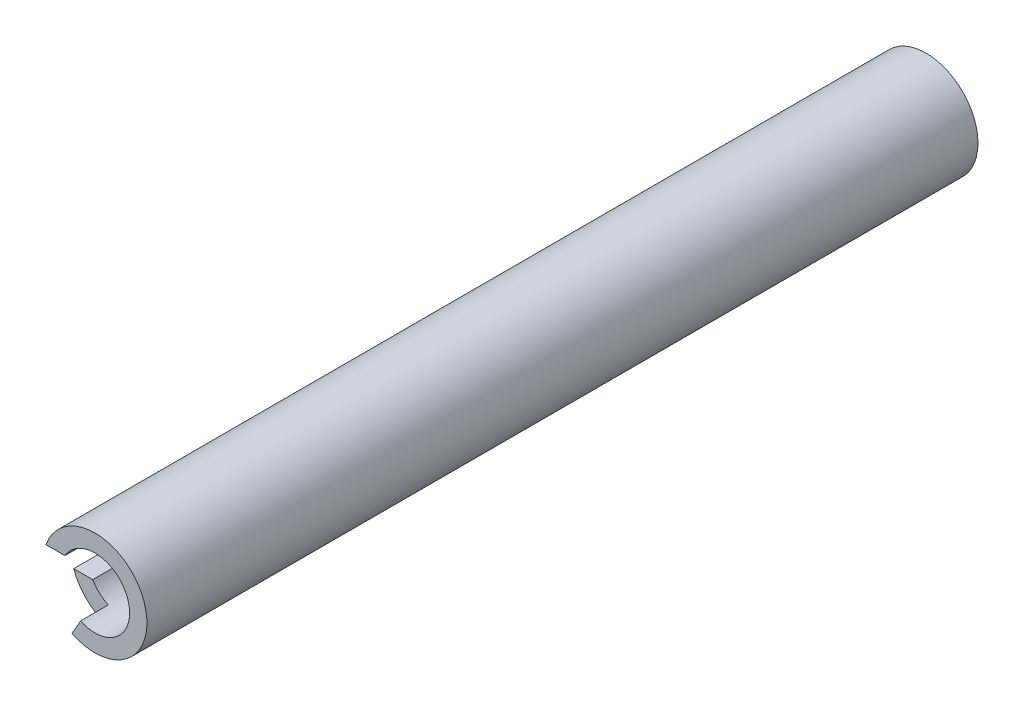
ISO-10303-21;
HEADER;
FILE_DESCRIPTION(('STEP AP214'),'2;1');
FILE_NAME('part.step','',(''),(''),'','','');
FILE_SCHEMA(('AUTOMOTIVE_DESIGN { 1 0 10303 214 1 1 1 1 }'));
ENDSEC;
DATA;
#1=APPLICATION_CONTEXT('core data for automotive mechanical design processes');
#2=APPLICATION_PROTOCOL_DEFINITION('international standard','automotive_design',2000,#1);
#3=PRODUCT_CONTEXT('',#1,'mechanical');
#4=PRODUCT('Part','Part','',(#3));
#5=PRODUCT_RELATED_PRODUCT_CATEGORY('part','',(#4));
#6=PRODUCT_DEFINITION_FORMATION('','',#4);
#7=PRODUCT_DEFINITION_CONTEXT('part definition',#1,'design');
#8=PRODUCT_DEFINITION('design','',#6,#7);
#9=PRODUCT_DEFINITION_SHAPE('','',#8);
#10=(LENGTH_UNIT() NAMED_UNIT(*) SI_UNIT(.MILLI.,.METRE.));
#11=(NAMED_UNIT(*) PLANE_ANGLE_UNIT() SI_UNIT($,.RADIAN.));
#12=(NAMED_UNIT(*) SI_UNIT($,.STERADIAN.) SOLID_ANGLE_UNIT());
#13=UNCERTAINTY_MEASURE_WITH_UNIT(LENGTH_MEASURE(1.E-05),#10,'distance_accuracy_value','');
#14=(GEOMETRIC_REPRESENTATION_CONTEXT(3) GLOBAL_UNCERTAINTY_ASSIGNED_CONTEXT((#13)) GLOBAL_UNIT_ASSIGNED_CONTEXT((#10,
#11,#12)) REPRESENTATION_CONTEXT('',''));
#15=CARTESIAN_POINT('',(0.,0.,0.));
#16=DIRECTION('',(0.,0.,1.));
#17=DIRECTION('',(1.,0.,0.));
#18=AXIS2_PLACEMENT_3D('',#15,#16,#17);
#19=CARTESIAN_POINT('',(0.,0.,304.8));
#20=DIRECTION('',(0.,0.,-1.));
#21=DIRECTION('',(-1.,0.,0.));
#22=AXIS2_PLACEMENT_3D('',#19,#20,#21);
#23=CYLINDRICAL_SURFACE('',#22,19.05);
#24=CARTESIAN_POINT('',(0.,0.,304.8));
#25=DIRECTION('',(0.,0.,1.));
#26=DIRECTION('',(1.,0.,0.));
#27=AXIS2_PLACEMENT_3D('',#24,#25,#26);
#28=CIRCLE('',#27,19.05);
#29=CARTESIAN_POINT('',(-8.43417142988597,-17.0811958683019,304.8));
#30=VERTEX_POINT('',#29);
#31=CARTESIAN_POINT('',(-17.9605122421383,6.35,304.8));
#32=VERTEX_POINT('',#31);
#33=EDGE_CURVE('E142',#30,#32,#28,.T.);
#34=ORIENTED_EDGE('',*,*,#33,.F.);
#35=DIRECTION('',(0.,0.,-1.));
#36=VECTOR('',#35,1.);
#37=CARTESIAN_POINT('',(-8.43417142988597,-17.0811958683019,304.8));
#38=LINE('',#37,#36);
#39=CARTESIAN_POINT('',(-8.43417142988597,-17.0811958683019,294.64));
#40=VERTEX_POINT('',#39);
#41=EDGE_CURVE('E106',#30,#40,#38,.T.);
#42=ORIENTED_EDGE('',*,*,#41,.T.);
#43=CARTESIAN_POINT('',(0.,0.,294.64));
#44=DIRECTION('',(0.,0.,-1.));
#45=DIRECTION('',(-1.,0.,0.));
#46=AXIS2_PLACEMENT_3D('',#43,#44,#45);
#47=CIRCLE('',#46,19.05);
#48=CARTESIAN_POINT('',(-17.9605122421383,-6.35,294.64));
#49=VERTEX_POINT('',#48);
#50=EDGE_CURVE('E93',#40,#49,#47,.T.);
#51=ORIENTED_EDGE('',*,*,#50,.T.);
#52=DIRECTION('',(0.,0.,-1.));
#53=VECTOR('',#52,1.);
#54=CARTESIAN_POINT('',(-17.9605122421383,-6.35,304.8));
#55=LINE('',#54,#53);
#56=CARTESIAN_POINT('',(-17.9605122421383,-6.35,34.29));
#57=VERTEX_POINT('',#56);
#58=EDGE_CURVE('E105',#49,#57,#55,.T.);
#59=ORIENTED_EDGE('',*,*,#58,.T.);
#60=CARTESIAN_POINT('',(0.,0.,34.29));
#61=DIRECTION('',(0.,0.,-1.));
#62=DIRECTION('',(-1.,0.,0.));
#63=AXIS2_PLACEMENT_3D('',#60,#61,#62);
#64=CIRCLE('',#63,19.05);
#65=CARTESIAN_POINT('',(-17.9605122421383,6.35,34.29));
#66=VERTEX_POINT('',#65);
#67=EDGE_CURVE('E113',#57,#66,#64,.T.);
#68=ORIENTED_EDGE('',*,*,#67,.T.);
#69=DIRECTION('',(0.,0.,-1.));
#70=VECTOR('',#69,1.);
#71=CARTESIAN_POINT('',(-17.9605122421383,6.35,304.8));
#72=LINE('',#71,#70);
#73=EDGE_CURVE('E118',#66,#32,#72,.F.);
#74=ORIENTED_EDGE('',*,*,#73,.T.);
#75=EDGE_LOOP('',(#34,#42,#51,#59,#68,#74));
#76=FACE_BOUND('',#75,.T.);
#77=CARTESIAN_POINT('',(0.,0.,0.));
#78=DIRECTION('',(0.,0.,1.));
#79=DIRECTION('',(1.,0.,0.));
#80=AXIS2_PLACEMENT_3D('',#77,#78,#79);
#81=CIRCLE('',#80,19.05);
#82=CARTESIAN_POINT('',(19.05,0.,0.));
#83=VERTEX_POINT('',#82);
#84=EDGE_CURVE('E139',#83,#83,#81,.T.);
#85=ORIENTED_EDGE('',*,*,#84,.T.);
#86=EDGE_LOOP('',(#85));
#87=FACE_BOUND('',#86,.T.);
#88=ADVANCED_FACE('F39',(#76,#87),#23,.T.);
#89=CARTESIAN_POINT('',(0.,0.,304.8));
#90=DIRECTION('',(0.,0.,1.));
#91=DIRECTION('',(1.,0.,0.));
#92=AXIS2_PLACEMENT_3D('',#89,#90,#91);
#93=PLANE('',#92);
#94=DIRECTION('',(0.492726548875349,0.870184203507159,0.));
#95=VECTOR('',#94,1.);
#96=CARTESIAN_POINT('',(0.937254471484058,-0.530703912218892,304.8));
#97=LINE('',#96,#95);
#98=CARTESIAN_POINT('',(-5.29782781869066,-11.5422277054088,304.8));
#99=VERTEX_POINT('',#98);
#100=EDGE_CURVE('E108',#30,#99,#97,.T.);
#101=ORIENTED_EDGE('',*,*,#100,.F.);
#102=ORIENTED_EDGE('',*,*,#33,.T.);
#103=DIRECTION('',(-1.,0.,0.));
#104=VECTOR('',#103,1.);
#105=CARTESIAN_POINT('',(0.,6.35,304.8));
#106=LINE('',#105,#104);
#107=CARTESIAN_POINT('',(-10.9985226280624,6.35,304.8));
#108=VERTEX_POINT('',#107);
#109=EDGE_CURVE('E112',#108,#32,#106,.T.);
#110=ORIENTED_EDGE('',*,*,#109,.F.);
#111=CARTESIAN_POINT('',(0.,0.,304.8));
#112=DIRECTION('',(0.,0.,1.));
#113=DIRECTION('',(1.,0.,0.));
#114=AXIS2_PLACEMENT_3D('',#111,#112,#113);
#115=CIRCLE('',#114,12.7);
#116=EDGE_CURVE('E131',#99,#108,#115,.T.);
#117=ORIENTED_EDGE('',*,*,#116,.F.);
#118=EDGE_LOOP('',(#101,#102,#110,#117));
#119=FACE_BOUND('',#118,.T.);
#120=ADVANCED_FACE('F170',(#119),#93,.T.);
#121=CARTESIAN_POINT('',(0.,0.,0.));
#122=DIRECTION('',(0.,0.,1.));
#123=DIRECTION('',(1.,0.,0.));
#124=AXIS2_PLACEMENT_3D('',#121,#122,#123);
#125=PLANE('',#124);
#126=CARTESIAN_POINT('',(0.,0.,0.));
#127=DIRECTION('',(0.,0.,-1.));
#128=DIRECTION('',(-1.,0.,0.));
#129=AXIS2_PLACEMENT_3D('',#126,#127,#128);
#130=CIRCLE('',#129,2.54);
#131=CARTESIAN_POINT('',(-2.54,0.,0.));
#132=VERTEX_POINT('',#131);
#133=EDGE_CURVE('E126',#132,#132,#130,.T.);
#134=ORIENTED_EDGE('',*,*,#133,.F.);
#135=EDGE_LOOP('',(#134));
#136=FACE_BOUND('',#135,.T.);
#137=ORIENTED_EDGE('',*,*,#84,.F.);
#138=EDGE_LOOP('',(#137));
#139=FACE_BOUND('',#138,.T.);
#140=ADVANCED_FACE('F198',(#136,#139),#125,.F.);
#141=CARTESIAN_POINT('',(0.,0.,31.75));
#142=DIRECTION('',(0.,0.,1.));
#143=DIRECTION('',(1.,0.,0.));
#144=AXIS2_PLACEMENT_3D('',#141,#142,#143);
#145=CYLINDRICAL_SURFACE('',#144,12.7);
#146=CARTESIAN_POINT('',(0.,0.,294.64));
#147=DIRECTION('',(0.,0.,-1.));
#148=DIRECTION('',(-1.,0.,0.));
#149=AXIS2_PLACEMENT_3D('',#146,#147,#148);
#150=CIRCLE('',#149,12.7);
#151=CARTESIAN_POINT('',(-10.9985226280624,-6.35,294.64));
#152=VERTEX_POINT('',#151);
#153=CARTESIAN_POINT('',(-5.29782781869066,-11.5422277054088,294.64));
#154=VERTEX_POINT('',#153);
#155=EDGE_CURVE('E54',#152,#154,#150,.F.);
#156=ORIENTED_EDGE('',*,*,#155,.T.);
#157=DIRECTION('',(0.,0.,1.));
#158=VECTOR('',#157,1.);
#159=CARTESIAN_POINT('',(-5.29782781869066,-11.5422277054088,31.75));
#160=LINE('',#159,#158);
#161=EDGE_CURVE('E11',#154,#99,#160,.T.);
#162=ORIENTED_EDGE('',*,*,#161,.T.);
#163=ORIENTED_EDGE('',*,*,#116,.T.);
#164=DIRECTION('',(0.,0.,1.));
#165=VECTOR('',#164,1.);
#166=CARTESIAN_POINT('',(-10.9985226280624,6.35,31.75));
#167=LINE('',#166,#165);
#168=CARTESIAN_POINT('',(-10.9985226280624,6.35,34.29));
#169=VERTEX_POINT('',#168);
#170=EDGE_CURVE('E99',#108,#169,#167,.F.);
#171=ORIENTED_EDGE('',*,*,#170,.T.);
#172=CARTESIAN_POINT('',(0.,0.,34.29));
#173=DIRECTION('',(0.,0.,-1.));
#174=DIRECTION('',(-1.,0.,0.));
#175=AXIS2_PLACEMENT_3D('',#172,#173,#174);
#176=CIRCLE('',#175,12.7);
#177=CARTESIAN_POINT('',(-10.9985226280624,-6.35,34.29));
#178=VERTEX_POINT('',#177);
#179=EDGE_CURVE('E145',#169,#178,#176,.F.);
#180=ORIENTED_EDGE('',*,*,#179,.T.);
#181=DIRECTION('',(0.,0.,1.));
#182=VECTOR('',#181,1.);
#183=CARTESIAN_POINT('',(-10.9985226280624,-6.35,31.75));
#184=LINE('',#183,#182);
#185=EDGE_CURVE('E152',#178,#152,#184,.T.);
#186=ORIENTED_EDGE('',*,*,#185,.T.);
#187=EDGE_LOOP('',(#156,#162,#163,#171,#180,#186));
#188=FACE_BOUND('',#187,.T.);
#189=CARTESIAN_POINT('',(0.,0.,31.75));
#190=DIRECTION('',(0.,0.,1.));
#191=DIRECTION('',(1.,0.,0.));
#192=AXIS2_PLACEMENT_3D('',#189,#190,#191);
#193=CIRCLE('',#192,12.7);
#194=CARTESIAN_POINT('',(12.7,0.,31.75));
#195=VERTEX_POINT('',#194);
#196=EDGE_CURVE('E135',#195,#195,#193,.T.);
#197=ORIENTED_EDGE('',*,*,#196,.F.);
#198=EDGE_LOOP('',(#197));
#199=FACE_BOUND('',#198,.T.);
#200=ADVANCED_FACE('F159',(#188,#199),#145,.F.);
#201=CARTESIAN_POINT('',(0.,0.,31.75));
#202=DIRECTION('',(0.,0.,1.));
#203=DIRECTION('',(1.,0.,0.));
#204=AXIS2_PLACEMENT_3D('',#201,#202,#203);
#205=PLANE('',#204);
#206=CARTESIAN_POINT('',(0.,0.,31.75));
#207=DIRECTION('',(0.,0.,-1.));
#208=DIRECTION('',(-1.,0.,0.));
#209=AXIS2_PLACEMENT_3D('',#206,#207,#208);
#210=CIRCLE('',#209,2.54);
#211=CARTESIAN_POINT('',(-2.54,0.,31.75));
#212=VERTEX_POINT('',#211);
#213=EDGE_CURVE('E127',#212,#212,#210,.T.);
#214=ORIENTED_EDGE('',*,*,#213,.T.);
#215=EDGE_LOOP('',(#214));
#216=FACE_BOUND('',#215,.T.);
#217=ORIENTED_EDGE('',*,*,#196,.T.);
#218=EDGE_LOOP('',(#217));
#219=FACE_BOUND('',#218,.T.);
#220=ADVANCED_FACE('F207',(#216,#219),#205,.T.);
#221=CARTESIAN_POINT('',(0.,0.,31.75));
#222=DIRECTION('',(0.,0.,-1.));
#223=DIRECTION('',(-1.,0.,0.));
#224=AXIS2_PLACEMENT_3D('',#221,#222,#223);
#225=CYLINDRICAL_SURFACE('',#224,2.54);
#226=ORIENTED_EDGE('',*,*,#213,.F.);
#227=EDGE_LOOP('',(#226));
#228=FACE_BOUND('',#227,.T.);
#229=ORIENTED_EDGE('',*,*,#133,.T.);
#230=EDGE_LOOP('',(#229));
#231=FACE_BOUND('',#230,.T.);
#232=ADVANCED_FACE('F210',(#228,#231),#225,.F.);
#233=CARTESIAN_POINT('',(-12.7,6.35,34.29));
#234=DIRECTION('',(0.,1.,0.));
#235=DIRECTION('',(0.,0.,1.));
#236=AXIS2_PLACEMENT_3D('',#233,#234,#235);
#237=PLANE('',#236);
#238=DIRECTION('',(-1.,0.,0.));
#239=VECTOR('',#238,1.);
#240=CARTESIAN_POINT('',(-20.2680379829838,6.35,34.29));
#241=LINE('',#240,#239);
#242=EDGE_CURVE('E167',#169,#66,#241,.T.);
#243=ORIENTED_EDGE('',*,*,#242,.F.);
#244=ORIENTED_EDGE('',*,*,#170,.F.);
#245=ORIENTED_EDGE('',*,*,#109,.T.);
#246=ORIENTED_EDGE('',*,*,#73,.F.);
#247=EDGE_LOOP('',(#243,#244,#245,#246));
#248=FACE_BOUND('',#247,.T.);
#249=ADVANCED_FACE('F165',(#248),#237,.F.);
#250=CARTESIAN_POINT('',(-8.71011639159073,-6.35,34.29));
#251=DIRECTION('',(0.,-1.,0.));
#252=DIRECTION('',(0.,0.,-1.));
#253=AXIS2_PLACEMENT_3D('',#250,#251,#252);
#254=PLANE('',#253);
#255=ORIENTED_EDGE('',*,*,#58,.F.);
#256=DIRECTION('',(1.,0.,0.));
#257=VECTOR('',#256,1.);
#258=CARTESIAN_POINT('',(-8.71011639159073,-6.35,294.64));
#259=LINE('',#258,#257);
#260=EDGE_CURVE('E47',#49,#152,#259,.T.);
#261=ORIENTED_EDGE('',*,*,#260,.T.);
#262=ORIENTED_EDGE('',*,*,#185,.F.);
#263=DIRECTION('',(1.,0.,0.));
#264=VECTOR('',#263,1.);
#265=CARTESIAN_POINT('',(-8.71011639159073,-6.35,34.29));
#266=LINE('',#265,#264);
#267=EDGE_CURVE('E62',#57,#178,#266,.T.);
#268=ORIENTED_EDGE('',*,*,#267,.F.);
#269=EDGE_LOOP('',(#255,#261,#262,#268));
#270=FACE_BOUND('',#269,.T.);
#271=ADVANCED_FACE('F110',(#270),#254,.F.);
#272=CARTESIAN_POINT('',(0.,0.,34.29));
#273=DIRECTION('',(0.,0.,-1.));
#274=DIRECTION('',(-1.,0.,0.));
#275=AXIS2_PLACEMENT_3D('',#272,#273,#274);
#276=PLANE('',#275);
#277=ORIENTED_EDGE('',*,*,#267,.T.);
#278=ORIENTED_EDGE('',*,*,#179,.F.);
#279=ORIENTED_EDGE('',*,*,#242,.T.);
#280=ORIENTED_EDGE('',*,*,#67,.F.);
#281=EDGE_LOOP('',(#277,#278,#279,#280));
#282=FACE_BOUND('',#281,.T.);
#283=ADVANCED_FACE('F171',(#282),#276,.F.);
#284=CARTESIAN_POINT('',(-4.2333134701158,-9.66223245723133,294.64));
#285=DIRECTION('',(0.870184203507159,-0.492726548875349,0.));
#286=DIRECTION('',(0.492726548875349,0.870184203507159,0.));
#287=AXIS2_PLACEMENT_3D('',#284,#285,#286);
#288=PLANE('',#287);
#289=ORIENTED_EDGE('',*,*,#100,.T.);
#290=ORIENTED_EDGE('',*,*,#161,.F.);
#291=DIRECTION('',(0.492726548875349,0.870184203507159,0.));
#292=VECTOR('',#291,1.);
#293=CARTESIAN_POINT('',(-4.2333134701158,-9.66223245723133,294.64));
#294=LINE('',#293,#292);
#295=EDGE_CURVE('E182',#40,#154,#294,.T.);
#296=ORIENTED_EDGE('',*,*,#295,.F.);
#297=ORIENTED_EDGE('',*,*,#41,.F.);
#298=EDGE_LOOP('',(#289,#290,#296,#297));
#299=FACE_BOUND('',#298,.T.);
#300=ADVANCED_FACE('F185',(#299),#288,.F.);
#301=CARTESIAN_POINT('',(0.,0.,294.64));
#302=DIRECTION('',(0.,0.,-1.));
#303=DIRECTION('',(-1.,0.,0.));
#304=AXIS2_PLACEMENT_3D('',#301,#302,#303);
#305=PLANE('',#304);
#306=ORIENTED_EDGE('',*,*,#295,.T.);
#307=ORIENTED_EDGE('',*,*,#155,.F.);
#308=ORIENTED_EDGE('',*,*,#260,.F.);
#309=ORIENTED_EDGE('',*,*,#50,.F.);
#310=EDGE_LOOP('',(#306,#307,#308,#309));
#311=FACE_BOUND('',#310,.T.);
#312=ADVANCED_FACE('F92',(#311),#305,.F.);
#313=CLOSED_SHELL('',(#88,#120,#140,#200,#220,#232,#249,#271,#283,#300,#312));
#314=MANIFOLD_SOLID_BREP('B2',#313);
#315=ADVANCED_BREP_SHAPE_REPRESENTATION('',(#18,#314),#14);
#316=SHAPE_DEFINITION_REPRESENTATION(#9,#315);
ENDSEC;
END-ISO-10303-21;
